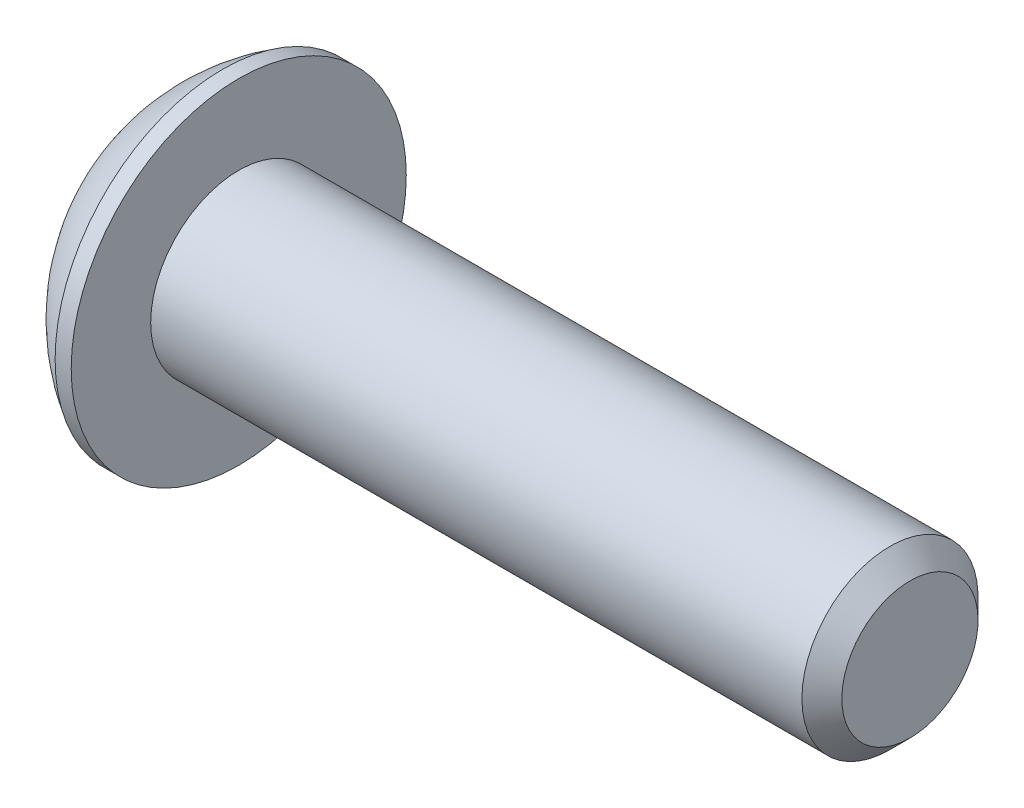
ISO-10303-21;
HEADER;
FILE_DESCRIPTION(('STEP AP214'),'2;1');
FILE_NAME('part.step','',(''),(''),'','','');
FILE_SCHEMA(('AUTOMOTIVE_DESIGN { 1 0 10303 214 1 1 1 1 }'));
ENDSEC;
DATA;
#1=APPLICATION_CONTEXT('core data for automotive mechanical design processes');
#2=APPLICATION_PROTOCOL_DEFINITION('international standard','automotive_design',2000,#1);
#3=PRODUCT_CONTEXT('',#1,'mechanical');
#4=PRODUCT('Part','Part','',(#3));
#5=PRODUCT_RELATED_PRODUCT_CATEGORY('part','',(#4));
#6=PRODUCT_DEFINITION_FORMATION('','',#4);
#7=PRODUCT_DEFINITION_CONTEXT('part definition',#1,'design');
#8=PRODUCT_DEFINITION('design','',#6,#7);
#9=PRODUCT_DEFINITION_SHAPE('','',#8);
#10=(LENGTH_UNIT() NAMED_UNIT(*) SI_UNIT(.MILLI.,.METRE.));
#11=(NAMED_UNIT(*) PLANE_ANGLE_UNIT() SI_UNIT($,.RADIAN.));
#12=(NAMED_UNIT(*) SI_UNIT($,.STERADIAN.) SOLID_ANGLE_UNIT());
#13=UNCERTAINTY_MEASURE_WITH_UNIT(LENGTH_MEASURE(1.E-05),#10,'distance_accuracy_value','');
#14=(GEOMETRIC_REPRESENTATION_CONTEXT(3) GLOBAL_UNCERTAINTY_ASSIGNED_CONTEXT((#13)) GLOBAL_UNIT_ASSIGNED_CONTEXT((#10,
#11,#12)) REPRESENTATION_CONTEXT('',''));
#15=CARTESIAN_POINT('',(0.,0.,0.));
#16=DIRECTION('',(0.,0.,1.));
#17=DIRECTION('',(1.,0.,0.));
#18=AXIS2_PLACEMENT_3D('',#15,#16,#17);
#19=CARTESIAN_POINT('',(1.32080207114083,0.,0.));
#20=DIRECTION('',(-1.,0.,0.));
#21=DIRECTION('',(0.,0.,1.));
#22=AXIS2_PLACEMENT_3D('',#19,#20,#21);
#23=CONICAL_SURFACE('',#22,1.19380119577328,1.0471975499995);
#24=CARTESIAN_POINT('',(2.01004351478429,0.,-4.44089209850063E-13));
#25=VERTEX_POINT('',#24);
#26=VERTEX_LOOP('',#25);
#27=FACE_BOUND('',#26,.T.);
#28=CARTESIAN_POINT('',(1.3208,0.,0.));
#29=DIRECTION('',(1.,0.,0.));
#30=DIRECTION('',(0.,0.,-1.));
#31=AXIS2_PLACEMENT_3D('',#28,#29,#30);
#32=CIRCLE('',#31,1.19380478309441);
#33=CARTESIAN_POINT('',(1.3208,1.0338631981785,0.596901195773596));
#34=VERTEX_POINT('',#33);
#35=CARTESIAN_POINT('',(1.3208,1.0338631981785,-0.5969011957736));
#36=VERTEX_POINT('',#35);
#37=EDGE_CURVE('E166',#34,#36,#32,.F.);
#38=ORIENTED_EDGE('',*,*,#37,.T.);
#39=CARTESIAN_POINT('',(1.3208,0.,0.));
#40=DIRECTION('',(1.,0.,0.));
#41=DIRECTION('',(0.,0.,-1.));
#42=AXIS2_PLACEMENT_3D('',#39,#40,#41);
#43=CIRCLE('',#42,1.19380478309441);
#44=CARTESIAN_POINT('',(1.3208,0.,-1.19380239154721));
#45=VERTEX_POINT('',#44);
#46=EDGE_CURVE('E168',#36,#45,#43,.F.);
#47=ORIENTED_EDGE('',*,*,#46,.T.);
#48=CARTESIAN_POINT('',(1.3208,0.,0.));
#49=DIRECTION('',(1.,0.,0.));
#50=DIRECTION('',(0.,0.,-1.));
#51=AXIS2_PLACEMENT_3D('',#48,#49,#50);
#52=CIRCLE('',#51,1.19380478309441);
#53=CARTESIAN_POINT('',(1.3208,-1.0338631981785,-0.596901195773596));
#54=VERTEX_POINT('',#53);
#55=EDGE_CURVE('E115',#45,#54,#52,.F.);
#56=ORIENTED_EDGE('',*,*,#55,.T.);
#57=CARTESIAN_POINT('',(1.3208,0.,0.));
#58=DIRECTION('',(1.,0.,0.));
#59=DIRECTION('',(0.,0.,-1.));
#60=AXIS2_PLACEMENT_3D('',#57,#58,#59);
#61=CIRCLE('',#60,1.19380478309441);
#62=CARTESIAN_POINT('',(1.3208,-1.0338631981785,0.5969011957736));
#63=VERTEX_POINT('',#62);
#64=EDGE_CURVE('E110',#54,#63,#61,.F.);
#65=ORIENTED_EDGE('',*,*,#64,.T.);
#66=CARTESIAN_POINT('',(1.3208,0.,0.));
#67=DIRECTION('',(1.,0.,0.));
#68=DIRECTION('',(0.,0.,-1.));
#69=AXIS2_PLACEMENT_3D('',#66,#67,#68);
#70=CIRCLE('',#69,1.19380478309441);
#71=CARTESIAN_POINT('',(1.3208,0.,1.19380239154721));
#72=VERTEX_POINT('',#71);
#73=EDGE_CURVE('E112',#63,#72,#70,.F.);
#74=ORIENTED_EDGE('',*,*,#73,.T.);
#75=CARTESIAN_POINT('',(1.3208,0.,0.));
#76=DIRECTION('',(1.,0.,0.));
#77=DIRECTION('',(0.,0.,-1.));
#78=AXIS2_PLACEMENT_3D('',#75,#76,#77);
#79=CIRCLE('',#78,1.19380478309441);
#80=EDGE_CURVE('E164',#72,#34,#79,.F.);
#81=ORIENTED_EDGE('',*,*,#80,.T.);
#82=EDGE_LOOP('',(#38,#47,#56,#65,#74,#81));
#83=FACE_BOUND('',#82,.T.);
#84=ADVANCED_FACE('F38',(#27,#83),#23,.F.);
#85=CARTESIAN_POINT('',(1.3208,-2.06772225407572,-1.1938));
#86=DIRECTION('',(1.,0.,0.));
#87=DIRECTION('',(0.,0.,-1.));
#88=AXIS2_PLACEMENT_3D('',#85,#86,#87);
#89=PLANE('',#88);
#90=DIRECTION('',(0.,0.5,0.866025403784439));
#91=VECTOR('',#90,1.);
#92=CARTESIAN_POINT('',(1.3208,-1.37848150271716,0.));
#93=LINE('',#92,#91);
#94=CARTESIAN_POINT('',(1.3208,-0.689240751358574,1.1938));
#95=VERTEX_POINT('',#94);
#96=EDGE_CURVE('E124',#95,#63,#93,.F.);
#97=ORIENTED_EDGE('',*,*,#96,.F.);
#98=DIRECTION('',(0.,1.,0.));
#99=VECTOR('',#98,1.);
#100=CARTESIAN_POINT('',(1.3208,-0.689240751358565,1.1938));
#101=LINE('',#100,#99);
#102=EDGE_CURVE('E126',#72,#95,#101,.F.);
#103=ORIENTED_EDGE('',*,*,#102,.F.);
#104=ORIENTED_EDGE('',*,*,#73,.F.);
#105=EDGE_LOOP('',(#97,#103,#104));
#106=FACE_BOUND('',#105,.T.);
#107=ADVANCED_FACE('F122',(#106),#89,.F.);
#108=CARTESIAN_POINT('',(1.3208,-2.06772225407572,-1.1938));
#109=DIRECTION('',(1.,0.,0.));
#110=DIRECTION('',(0.,0.,-1.));
#111=AXIS2_PLACEMENT_3D('',#108,#109,#110);
#112=PLANE('',#111);
#113=DIRECTION('',(0.,-0.5,0.866025403784439));
#114=VECTOR('',#113,1.);
#115=CARTESIAN_POINT('',(1.3208,-0.689240751358565,-1.1938));
#116=LINE('',#115,#114);
#117=CARTESIAN_POINT('',(1.3208,-1.37848150271715,0.));
#118=VERTEX_POINT('',#117);
#119=EDGE_CURVE('E133',#118,#54,#116,.F.);
#120=ORIENTED_EDGE('',*,*,#119,.F.);
#121=DIRECTION('',(0.,0.5,0.866025403784439));
#122=VECTOR('',#121,1.);
#123=CARTESIAN_POINT('',(1.3208,-1.37848150271716,0.));
#124=LINE('',#123,#122);
#125=EDGE_CURVE('E130',#63,#118,#124,.F.);
#126=ORIENTED_EDGE('',*,*,#125,.F.);
#127=ORIENTED_EDGE('',*,*,#64,.F.);
#128=EDGE_LOOP('',(#120,#126,#127));
#129=FACE_BOUND('',#128,.T.);
#130=ADVANCED_FACE('F131',(#129),#112,.F.);
#131=CARTESIAN_POINT('',(1.3208,-2.06772225407572,-1.1938));
#132=DIRECTION('',(1.,0.,0.));
#133=DIRECTION('',(0.,0.,-1.));
#134=AXIS2_PLACEMENT_3D('',#131,#132,#133);
#135=PLANE('',#134);
#136=DIRECTION('',(0.,1.,0.));
#137=VECTOR('',#136,1.);
#138=CARTESIAN_POINT('',(1.3208,0.689240751358565,-1.1938));
#139=LINE('',#138,#137);
#140=CARTESIAN_POINT('',(1.3208,-0.689240751358565,-1.1938));
#141=VERTEX_POINT('',#140);
#142=EDGE_CURVE('E379',#141,#45,#139,.T.);
#143=ORIENTED_EDGE('',*,*,#142,.F.);
#144=DIRECTION('',(0.,-0.5,0.866025403784439));
#145=VECTOR('',#144,1.);
#146=CARTESIAN_POINT('',(1.3208,-0.689240751358565,-1.1938));
#147=LINE('',#146,#145);
#148=EDGE_CURVE('E381',#54,#141,#147,.F.);
#149=ORIENTED_EDGE('',*,*,#148,.F.);
#150=ORIENTED_EDGE('',*,*,#55,.F.);
#151=EDGE_LOOP('',(#143,#149,#150));
#152=FACE_BOUND('',#151,.T.);
#153=ADVANCED_FACE('F227',(#152),#135,.F.);
#154=CARTESIAN_POINT('',(1.3208,-2.06772225407572,-1.1938));
#155=DIRECTION('',(1.,0.,0.));
#156=DIRECTION('',(0.,0.,-1.));
#157=AXIS2_PLACEMENT_3D('',#154,#155,#156);
#158=PLANE('',#157);
#159=DIRECTION('',(0.,-0.5,-0.866025403784439));
#160=VECTOR('',#159,1.);
#161=CARTESIAN_POINT('',(1.3208,1.37848150271716,0.));
#162=LINE('',#161,#160);
#163=CARTESIAN_POINT('',(1.3208,0.689240751358574,-1.1938));
#164=VERTEX_POINT('',#163);
#165=EDGE_CURVE('E395',#164,#36,#162,.F.);
#166=ORIENTED_EDGE('',*,*,#165,.F.);
#167=DIRECTION('',(0.,1.,0.));
#168=VECTOR('',#167,1.);
#169=CARTESIAN_POINT('',(1.3208,0.689240751358565,-1.1938));
#170=LINE('',#169,#168);
#171=EDGE_CURVE('E385',#45,#164,#170,.T.);
#172=ORIENTED_EDGE('',*,*,#171,.F.);
#173=ORIENTED_EDGE('',*,*,#46,.F.);
#174=EDGE_LOOP('',(#166,#172,#173));
#175=FACE_BOUND('',#174,.T.);
#176=ADVANCED_FACE('F223',(#175),#158,.F.);
#177=CARTESIAN_POINT('',(1.3208,-2.06772225407572,-1.1938));
#178=DIRECTION('',(1.,0.,0.));
#179=DIRECTION('',(0.,0.,-1.));
#180=AXIS2_PLACEMENT_3D('',#177,#178,#179);
#181=PLANE('',#180);
#182=DIRECTION('',(0.,0.5,-0.866025403784439));
#183=VECTOR('',#182,1.);
#184=CARTESIAN_POINT('',(1.3208,0.689240751358565,1.1938));
#185=LINE('',#184,#183);
#186=CARTESIAN_POINT('',(1.3208,1.37848150271715,0.));
#187=VERTEX_POINT('',#186);
#188=EDGE_CURVE('E426',#187,#34,#185,.F.);
#189=ORIENTED_EDGE('',*,*,#188,.F.);
#190=DIRECTION('',(0.,-0.5,-0.866025403784439));
#191=VECTOR('',#190,1.);
#192=CARTESIAN_POINT('',(1.3208,1.37848150271716,0.));
#193=LINE('',#192,#191);
#194=EDGE_CURVE('E398',#36,#187,#193,.F.);
#195=ORIENTED_EDGE('',*,*,#194,.F.);
#196=ORIENTED_EDGE('',*,*,#37,.F.);
#197=EDGE_LOOP('',(#189,#195,#196));
#198=FACE_BOUND('',#197,.T.);
#199=ADVANCED_FACE('F219',(#198),#181,.F.);
#200=CARTESIAN_POINT('',(1.3208,-2.06772225407572,-1.1938));
#201=DIRECTION('',(1.,0.,0.));
#202=DIRECTION('',(0.,0.,-1.));
#203=AXIS2_PLACEMENT_3D('',#200,#201,#202);
#204=PLANE('',#203);
#205=DIRECTION('',(0.,1.,0.));
#206=VECTOR('',#205,1.);
#207=CARTESIAN_POINT('',(1.3208,-0.689240751358565,1.1938));
#208=LINE('',#207,#206);
#209=CARTESIAN_POINT('',(1.3208,0.689240751358565,1.1938));
#210=VERTEX_POINT('',#209);
#211=EDGE_CURVE('E142',#210,#72,#208,.F.);
#212=ORIENTED_EDGE('',*,*,#211,.F.);
#213=DIRECTION('',(0.,0.5,-0.866025403784439));
#214=VECTOR('',#213,1.);
#215=CARTESIAN_POINT('',(1.3208,0.689240751358565,1.1938));
#216=LINE('',#215,#214);
#217=EDGE_CURVE('E429',#34,#210,#216,.F.);
#218=ORIENTED_EDGE('',*,*,#217,.F.);
#219=ORIENTED_EDGE('',*,*,#80,.F.);
#220=EDGE_LOOP('',(#212,#218,#219));
#221=FACE_BOUND('',#220,.T.);
#222=ADVANCED_FACE('F215',(#221),#204,.F.);
#223=CARTESIAN_POINT('',(1.3208,-0.689240751358565,1.1938));
#224=DIRECTION('',(0.,0.,-1.));
#225=DIRECTION('',(-1.,0.,0.));
#226=AXIS2_PLACEMENT_3D('',#223,#224,#225);
#227=PLANE('',#226);
#228=DIRECTION('',(0.,1.,0.));
#229=VECTOR('',#228,1.);
#230=CARTESIAN_POINT('',(0.,0.,1.1938));
#231=LINE('',#230,#229);
#232=CARTESIAN_POINT('',(0.,0.689240751358565,1.1938));
#233=VERTEX_POINT('',#232);
#234=CARTESIAN_POINT('',(0.,-0.689240751358568,1.1938));
#235=VERTEX_POINT('',#234);
#236=EDGE_CURVE('E414',#233,#235,#231,.F.);
#237=ORIENTED_EDGE('',*,*,#236,.F.);
#238=DIRECTION('',(1.,0.,0.));
#239=VECTOR('',#238,1.);
#240=CARTESIAN_POINT('',(1.3208,0.689240751358565,1.1938));
#241=LINE('',#240,#239);
#242=EDGE_CURVE('E422',#210,#233,#241,.F.);
#243=ORIENTED_EDGE('',*,*,#242,.F.);
#244=ORIENTED_EDGE('',*,*,#211,.T.);
#245=ORIENTED_EDGE('',*,*,#102,.T.);
#246=DIRECTION('',(1.,0.,0.));
#247=VECTOR('',#246,1.);
#248=CARTESIAN_POINT('',(1.3208,-0.689240751358576,1.19380000000001));
#249=LINE('',#248,#247);
#250=EDGE_CURVE('E136',#235,#95,#249,.T.);
#251=ORIENTED_EDGE('',*,*,#250,.F.);
#252=EDGE_LOOP('',(#237,#243,#244,#245,#251));
#253=FACE_BOUND('',#252,.T.);
#254=ADVANCED_FACE('F212',(#253),#227,.T.);
#255=CARTESIAN_POINT('',(1.3208,-1.37848150271716,0.));
#256=DIRECTION('',(0.,0.866025403784439,-0.5));
#257=DIRECTION('',(0.,0.5,0.866025403784439));
#258=AXIS2_PLACEMENT_3D('',#255,#256,#257);
#259=PLANE('',#258);
#260=DIRECTION('',(0.,-0.500000000000008,-0.866025403784434));
#261=VECTOR('',#260,1.);
#262=CARTESIAN_POINT('',(0.,-0.689240751358565,1.1938));
#263=LINE('',#262,#261);
#264=CARTESIAN_POINT('',(0.,-1.37848150271715,0.));
#265=VERTEX_POINT('',#264);
#266=EDGE_CURVE('E412',#235,#265,#263,.T.);
#267=ORIENTED_EDGE('',*,*,#266,.F.);
#268=ORIENTED_EDGE('',*,*,#250,.T.);
#269=ORIENTED_EDGE('',*,*,#96,.T.);
#270=ORIENTED_EDGE('',*,*,#125,.T.);
#271=DIRECTION('',(1.,0.,0.));
#272=VECTOR('',#271,1.);
#273=CARTESIAN_POINT('',(1.3208,-1.37848150271714,0.));
#274=LINE('',#273,#272);
#275=EDGE_CURVE('E386',#265,#118,#274,.T.);
#276=ORIENTED_EDGE('',*,*,#275,.F.);
#277=EDGE_LOOP('',(#267,#268,#269,#270,#276));
#278=FACE_BOUND('',#277,.T.);
#279=ADVANCED_FACE('F140',(#278),#259,.T.);
#280=CARTESIAN_POINT('',(1.3208,-0.689240751358565,-1.1938));
#281=DIRECTION('',(0.,0.866025403784439,0.5));
#282=DIRECTION('',(0.,-0.5,0.866025403784439));
#283=AXIS2_PLACEMENT_3D('',#280,#281,#282);
#284=PLANE('',#283);
#285=DIRECTION('',(0.,0.500000000000008,-0.866025403784434));
#286=VECTOR('',#285,1.);
#287=CARTESIAN_POINT('',(0.,-1.37848150271716,0.));
#288=LINE('',#287,#286);
#289=CARTESIAN_POINT('',(0.,-0.689240751358565,-1.1938));
#290=VERTEX_POINT('',#289);
#291=EDGE_CURVE('E410',#265,#290,#288,.T.);
#292=ORIENTED_EDGE('',*,*,#291,.F.);
#293=ORIENTED_EDGE('',*,*,#275,.T.);
#294=ORIENTED_EDGE('',*,*,#119,.T.);
#295=ORIENTED_EDGE('',*,*,#148,.T.);
#296=DIRECTION('',(1.,0.,0.));
#297=VECTOR('',#296,1.);
#298=CARTESIAN_POINT('',(1.3208,-0.689240751358565,-1.1938));
#299=LINE('',#298,#297);
#300=EDGE_CURVE('E389',#290,#141,#299,.T.);
#301=ORIENTED_EDGE('',*,*,#300,.F.);
#302=EDGE_LOOP('',(#292,#293,#294,#295,#301));
#303=FACE_BOUND('',#302,.T.);
#304=ADVANCED_FACE('F205',(#303),#284,.T.);
#305=CARTESIAN_POINT('',(1.3208,0.689240751358565,-1.1938));
#306=DIRECTION('',(0.,0.,1.));
#307=DIRECTION('',(1.,0.,0.));
#308=AXIS2_PLACEMENT_3D('',#305,#306,#307);
#309=PLANE('',#308);
#310=DIRECTION('',(0.,1.,0.));
#311=VECTOR('',#310,1.);
#312=CARTESIAN_POINT('',(0.,0.,-1.1938));
#313=LINE('',#312,#311);
#314=CARTESIAN_POINT('',(0.,0.689240751358568,-1.1938));
#315=VERTEX_POINT('',#314);
#316=EDGE_CURVE('E393',#290,#315,#313,.T.);
#317=ORIENTED_EDGE('',*,*,#316,.F.);
#318=ORIENTED_EDGE('',*,*,#300,.T.);
#319=ORIENTED_EDGE('',*,*,#142,.T.);
#320=ORIENTED_EDGE('',*,*,#171,.T.);
#321=DIRECTION('',(1.,0.,0.));
#322=VECTOR('',#321,1.);
#323=CARTESIAN_POINT('',(1.3208,0.689240751358576,-1.19380000000001));
#324=LINE('',#323,#322);
#325=EDGE_CURVE('E430',#315,#164,#324,.T.);
#326=ORIENTED_EDGE('',*,*,#325,.F.);
#327=EDGE_LOOP('',(#317,#318,#319,#320,#326));
#328=FACE_BOUND('',#327,.T.);
#329=ADVANCED_FACE('F202',(#328),#309,.T.);
#330=CARTESIAN_POINT('',(1.3208,1.37848150271716,0.));
#331=DIRECTION('',(0.,-0.866025403784439,0.5));
#332=DIRECTION('',(0.,-0.5,-0.866025403784439));
#333=AXIS2_PLACEMENT_3D('',#330,#331,#332);
#334=PLANE('',#333);
#335=DIRECTION('',(0.,0.500000000000008,0.866025403784434));
#336=VECTOR('',#335,1.);
#337=CARTESIAN_POINT('',(0.,0.689240751358565,-1.1938));
#338=LINE('',#337,#336);
#339=CARTESIAN_POINT('',(0.,1.37848150271715,0.));
#340=VERTEX_POINT('',#339);
#341=EDGE_CURVE('E457',#315,#340,#338,.T.);
#342=ORIENTED_EDGE('',*,*,#341,.F.);
#343=ORIENTED_EDGE('',*,*,#325,.T.);
#344=ORIENTED_EDGE('',*,*,#165,.T.);
#345=ORIENTED_EDGE('',*,*,#194,.T.);
#346=DIRECTION('',(1.,0.,0.));
#347=VECTOR('',#346,1.);
#348=CARTESIAN_POINT('',(1.3208,1.37848150271714,0.));
#349=LINE('',#348,#347);
#350=EDGE_CURVE('E56',#340,#187,#349,.T.);
#351=ORIENTED_EDGE('',*,*,#350,.F.);
#352=EDGE_LOOP('',(#342,#343,#344,#345,#351));
#353=FACE_BOUND('',#352,.T.);
#354=ADVANCED_FACE('F198',(#353),#334,.T.);
#355=CARTESIAN_POINT('',(1.3208,0.689240751358565,1.1938));
#356=DIRECTION('',(0.,-0.866025403784439,-0.5));
#357=DIRECTION('',(0.,0.5,-0.866025403784439));
#358=AXIS2_PLACEMENT_3D('',#355,#356,#357);
#359=PLANE('',#358);
#360=DIRECTION('',(0.,-0.500000000000008,0.866025403784434));
#361=VECTOR('',#360,1.);
#362=CARTESIAN_POINT('',(0.,1.37848150271716,0.));
#363=LINE('',#362,#361);
#364=EDGE_CURVE('E163',#340,#233,#363,.T.);
#365=ORIENTED_EDGE('',*,*,#364,.F.);
#366=ORIENTED_EDGE('',*,*,#350,.T.);
#367=ORIENTED_EDGE('',*,*,#188,.T.);
#368=ORIENTED_EDGE('',*,*,#217,.T.);
#369=ORIENTED_EDGE('',*,*,#242,.T.);
#370=EDGE_LOOP('',(#365,#366,#367,#368,#369));
#371=FACE_BOUND('',#370,.T.);
#372=ADVANCED_FACE('F194',(#371),#359,.T.);
#373=CARTESIAN_POINT('',(0.,0.,0.));
#374=DIRECTION('',(-1.,0.,0.));
#375=DIRECTION('',(0.,0.,1.));
#376=AXIS2_PLACEMENT_3D('',#373,#374,#375);
#377=PLANE('',#376);
#378=ORIENTED_EDGE('',*,*,#341,.T.);
#379=ORIENTED_EDGE('',*,*,#364,.T.);
#380=ORIENTED_EDGE('',*,*,#236,.T.);
#381=ORIENTED_EDGE('',*,*,#266,.T.);
#382=ORIENTED_EDGE('',*,*,#291,.T.);
#383=ORIENTED_EDGE('',*,*,#316,.T.);
#384=EDGE_LOOP('',(#378,#379,#380,#381,#382,#383));
#385=FACE_BOUND('',#384,.T.);
#386=CARTESIAN_POINT('',(0.,0.,0.));
#387=DIRECTION('',(1.,0.,0.));
#388=DIRECTION('',(0.,0.,-1.));
#389=AXIS2_PLACEMENT_3D('',#386,#387,#388);
#390=CIRCLE('',#389,1.9812);
#391=CARTESIAN_POINT('',(0.,0.,-1.9812));
#392=VERTEX_POINT('',#391);
#393=EDGE_CURVE('E159',#392,#392,#390,.T.);
#394=ORIENTED_EDGE('',*,*,#393,.F.);
#395=EDGE_LOOP('',(#394));
#396=FACE_BOUND('',#395,.T.);
#397=ADVANCED_FACE('F188',(#385,#396),#377,.T.);
#398=CARTESIAN_POINT('',(4.13385,0.,0.));
#399=DIRECTION('',(1.,0.,0.));
#400=DIRECTION('',(0.,1.,0.));
#401=AXIS2_PLACEMENT_3D('',#398,#399,#400);
#402=SPHERICAL_SURFACE('',#401,4.58408870578439);
#403=ORIENTED_EDGE('',*,*,#393,.T.);
#404=EDGE_LOOP('',(#403));
#405=FACE_BOUND('',#404,.T.);
#406=CARTESIAN_POINT('',(1.8288,0.,0.));
#407=DIRECTION('',(-1.,0.,0.));
#408=DIRECTION('',(0.,0.,1.));
#409=AXIS2_PLACEMENT_3D('',#406,#407,#408);
#410=CIRCLE('',#409,3.9624);
#411=CARTESIAN_POINT('',(1.8288,0.,3.9624));
#412=VERTEX_POINT('',#411);
#413=EDGE_CURVE('E162',#412,#412,#410,.F.);
#414=ORIENTED_EDGE('',*,*,#413,.F.);
#415=EDGE_LOOP('',(#414));
#416=FACE_BOUND('',#415,.T.);
#417=ADVANCED_FACE('F184',(#405,#416),#402,.T.);
#418=CARTESIAN_POINT('',(18.0848,0.,0.));
#419=DIRECTION('',(-1.,0.,0.));
#420=DIRECTION('',(0.,0.,1.));
#421=AXIS2_PLACEMENT_3D('',#418,#419,#420);
#422=PLANE('',#421);
#423=CARTESIAN_POINT('',(18.08480002135,0.,0.));
#424=DIRECTION('',(-1.,0.,0.));
#425=DIRECTION('',(0.,-1.,0.));
#426=AXIS2_PLACEMENT_3D('',#423,#424,#425);
#427=CIRCLE('',#426,1.61036002134998);
#428=CARTESIAN_POINT('',(18.08480002135,-1.61036002134998,0.));
#429=VERTEX_POINT('',#428);
#430=EDGE_CURVE('E158',#429,#429,#427,.T.);
#431=ORIENTED_EDGE('',*,*,#430,.F.);
#432=EDGE_LOOP('',(#431));
#433=FACE_BOUND('',#432,.T.);
#434=ADVANCED_FACE('F40',(#433),#422,.F.);
#435=CARTESIAN_POINT('',(0.,0.,0.));
#436=DIRECTION('',(-1.,0.,0.));
#437=DIRECTION('',(0.,0.,1.));
#438=AXIS2_PLACEMENT_3D('',#435,#436,#437);
#439=CYLINDRICAL_SURFACE('',#438,3.9624);
#440=CARTESIAN_POINT('',(2.2098,0.,0.));
#441=DIRECTION('',(-1.,0.,0.));
#442=DIRECTION('',(0.,0.,1.));
#443=AXIS2_PLACEMENT_3D('',#440,#441,#442);
#444=CIRCLE('',#443,3.9624);
#445=CARTESIAN_POINT('',(2.2098,0.,3.9624));
#446=VERTEX_POINT('',#445);
#447=EDGE_CURVE('E155',#446,#446,#444,.T.);
#448=ORIENTED_EDGE('',*,*,#447,.T.);
#449=EDGE_LOOP('',(#448));
#450=FACE_BOUND('',#449,.T.);
#451=ORIENTED_EDGE('',*,*,#413,.T.);
#452=EDGE_LOOP('',(#451));
#453=FACE_BOUND('',#452,.T.);
#454=ADVANCED_FACE('F190',(#450,#453),#439,.T.);
#455=CARTESIAN_POINT('',(17.612360020926,0.,0.));
#456=DIRECTION('',(-1.,0.,0.));
#457=DIRECTION('',(0.,-1.,0.));
#458=AXIS2_PLACEMENT_3D('',#455,#456,#457);
#459=CONICAL_SURFACE('',#458,2.08280002092598,0.785398162499992);
#460=CARTESIAN_POINT('',(17.61236,0.,0.));
#461=DIRECTION('',(-1.,0.,0.));
#462=DIRECTION('',(0.,0.,1.));
#463=AXIS2_PLACEMENT_3D('',#460,#461,#462);
#464=CIRCLE('',#463,2.0828);
#465=CARTESIAN_POINT('',(17.61236,0.,2.0828));
#466=VERTEX_POINT('',#465);
#467=EDGE_CURVE('E42',#466,#466,#464,.T.);
#468=ORIENTED_EDGE('',*,*,#467,.F.);
#469=EDGE_LOOP('',(#468));
#470=FACE_BOUND('',#469,.T.);
#471=ORIENTED_EDGE('',*,*,#430,.T.);
#472=EDGE_LOOP('',(#471));
#473=FACE_BOUND('',#472,.T.);
#474=ADVANCED_FACE('F238',(#470,#473),#459,.T.);
#475=CARTESIAN_POINT('',(2.2098,2.0828,0.));
#476=DIRECTION('',(-1.,0.,0.));
#477=DIRECTION('',(0.,0.,1.));
#478=AXIS2_PLACEMENT_3D('',#475,#476,#477);
#479=PLANE('',#478);
#480=CARTESIAN_POINT('',(2.2098,0.,0.));
#481=DIRECTION('',(-1.,0.,0.));
#482=DIRECTION('',(0.,0.,1.));
#483=AXIS2_PLACEMENT_3D('',#480,#481,#482);
#484=CIRCLE('',#483,2.0828);
#485=CARTESIAN_POINT('',(2.2098,0.,2.0828));
#486=VERTEX_POINT('',#485);
#487=EDGE_CURVE('E12',#486,#486,#484,.F.);
#488=ORIENTED_EDGE('',*,*,#487,.F.);
#489=EDGE_LOOP('',(#488));
#490=FACE_BOUND('',#489,.T.);
#491=ORIENTED_EDGE('',*,*,#447,.F.);
#492=EDGE_LOOP('',(#491));
#493=FACE_BOUND('',#492,.T.);
#494=ADVANCED_FACE('F240',(#490,#493),#479,.F.);
#495=CARTESIAN_POINT('',(0.,0.,0.));
#496=DIRECTION('',(-1.,0.,0.));
#497=DIRECTION('',(0.,0.,1.));
#498=AXIS2_PLACEMENT_3D('',#495,#496,#497);
#499=CYLINDRICAL_SURFACE('',#498,2.0828);
#500=ORIENTED_EDGE('',*,*,#487,.T.);
#501=EDGE_LOOP('',(#500));
#502=FACE_BOUND('',#501,.T.);
#503=ORIENTED_EDGE('',*,*,#467,.T.);
#504=EDGE_LOOP('',(#503));
#505=FACE_BOUND('',#504,.T.);
#506=ADVANCED_FACE('F246',(#502,#505),#499,.T.);
#507=CLOSED_SHELL('',(#84,#107,#130,#153,#176,#199,#222,#254,#279,#304,#329,#354,#372,#397,#417,
#434,#454,#474,#494,#506));
#508=MANIFOLD_SOLID_BREP('B2',#507);
#509=ADVANCED_BREP_SHAPE_REPRESENTATION('',(#18,#508),#14);
#510=SHAPE_DEFINITION_REPRESENTATION(#9,#509);
ENDSEC;
END-ISO-10303-21;
